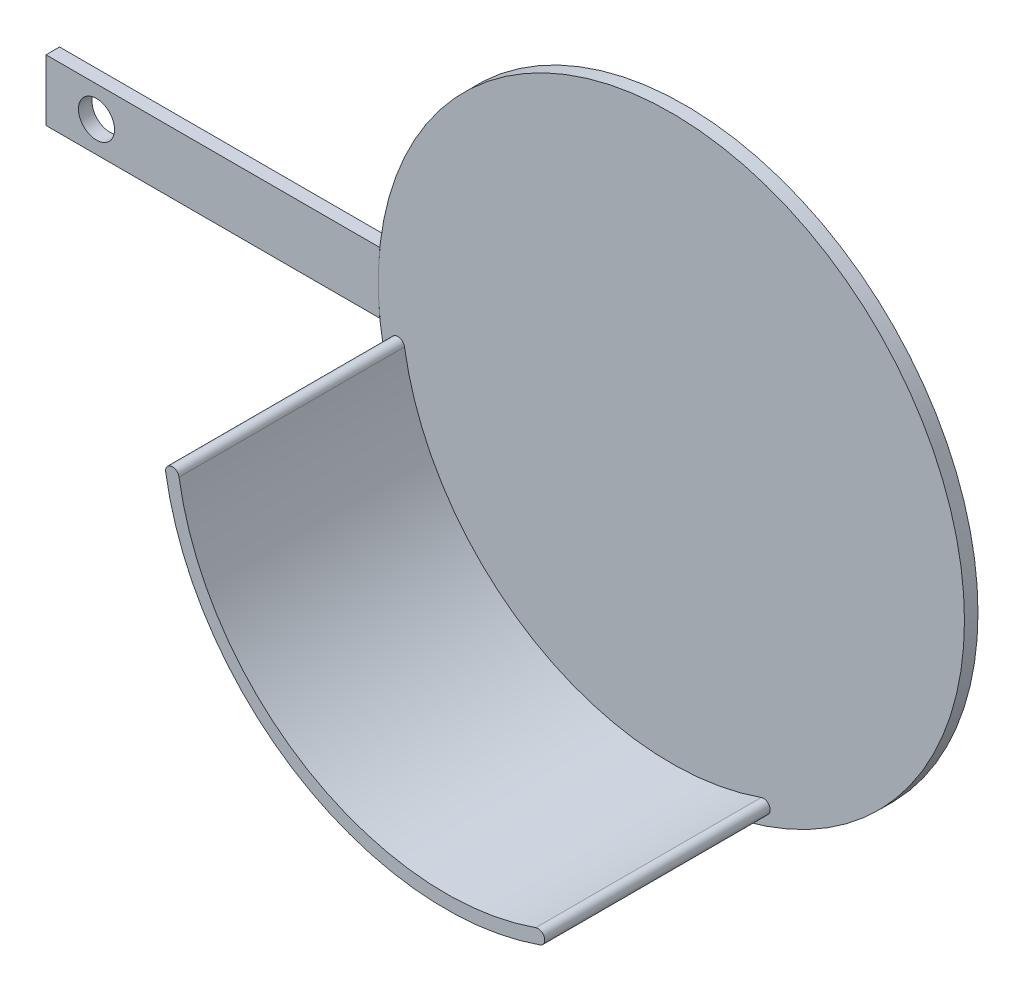
ISO-10303-21;
HEADER;
FILE_DESCRIPTION(('STEP AP214'),'2;1');
FILE_NAME('part.step','',(''),(''),'','','');
FILE_SCHEMA(('AUTOMOTIVE_DESIGN { 1 0 10303 214 1 1 1 1 }'));
ENDSEC;
DATA;
#1=APPLICATION_CONTEXT('core data for automotive mechanical design processes');
#2=APPLICATION_PROTOCOL_DEFINITION('international standard','automotive_design',2000,#1);
#3=PRODUCT_CONTEXT('',#1,'mechanical');
#4=PRODUCT('Part','Part','',(#3));
#5=PRODUCT_RELATED_PRODUCT_CATEGORY('part','',(#4));
#6=PRODUCT_DEFINITION_FORMATION('','',#4);
#7=PRODUCT_DEFINITION_CONTEXT('part definition',#1,'design');
#8=PRODUCT_DEFINITION('design','',#6,#7);
#9=PRODUCT_DEFINITION_SHAPE('','',#8);
#10=(LENGTH_UNIT() NAMED_UNIT(*) SI_UNIT(.MILLI.,.METRE.));
#11=(NAMED_UNIT(*) PLANE_ANGLE_UNIT() SI_UNIT($,.RADIAN.));
#12=(NAMED_UNIT(*) SI_UNIT($,.STERADIAN.) SOLID_ANGLE_UNIT());
#13=UNCERTAINTY_MEASURE_WITH_UNIT(LENGTH_MEASURE(1.E-05),#10,'distance_accuracy_value','');
#14=(GEOMETRIC_REPRESENTATION_CONTEXT(3) GLOBAL_UNCERTAINTY_ASSIGNED_CONTEXT((#13)) GLOBAL_UNIT_ASSIGNED_CONTEXT((#10,
#11,#12)) REPRESENTATION_CONTEXT('',''));
#15=CARTESIAN_POINT('',(0.,0.,0.));
#16=DIRECTION('',(0.,0.,1.));
#17=DIRECTION('',(1.,0.,0.));
#18=AXIS2_PLACEMENT_3D('',#15,#16,#17);
#19=CARTESIAN_POINT('',(0.,0.,3.));
#20=DIRECTION('',(0.,0.,-1.));
#21=DIRECTION('',(-1.,0.,0.));
#22=AXIS2_PLACEMENT_3D('',#19,#20,#21);
#23=CYLINDRICAL_SURFACE('',#22,65.);
#24=CARTESIAN_POINT('',(0.,0.,0.));
#25=DIRECTION('',(0.,0.,1.));
#26=DIRECTION('',(-1.,0.,0.));
#27=AXIS2_PLACEMENT_3D('',#24,#25,#26);
#28=CIRCLE('',#27,65.);
#29=CARTESIAN_POINT('',(-64.6439231989377,6.79435011239753,0.));
#30=VERTEX_POINT('',#29);
#31=CARTESIAN_POINT('',(-64.6439231989378,-6.79435011239749,0.));
#32=VERTEX_POINT('',#31);
#33=EDGE_CURVE('E115',#30,#32,#28,.T.);
#34=ORIENTED_EDGE('',*,*,#33,.F.);
#35=DIRECTION('',(0.,0.,-1.));
#36=VECTOR('',#35,1.);
#37=CARTESIAN_POINT('',(-64.6439231989377,6.79435011239753,3.));
#38=LINE('',#37,#36);
#39=CARTESIAN_POINT('',(-64.6439231989377,6.79435011239753,3.));
#40=VERTEX_POINT('',#39);
#41=EDGE_CURVE('E12',#40,#30,#38,.T.);
#42=ORIENTED_EDGE('',*,*,#41,.F.);
#43=CARTESIAN_POINT('',(0.,0.,3.));
#44=DIRECTION('',(0.,0.,1.));
#45=DIRECTION('',(-1.,0.,0.));
#46=AXIS2_PLACEMENT_3D('',#43,#44,#45);
#47=CIRCLE('',#46,65.);
#48=CARTESIAN_POINT('',(-64.6439231989378,-6.79435011239749,3.));
#49=VERTEX_POINT('',#48);
#50=EDGE_CURVE('E108',#40,#49,#47,.T.);
#51=ORIENTED_EDGE('',*,*,#50,.T.);
#52=DIRECTION('',(0.,0.,-1.));
#53=VECTOR('',#52,1.);
#54=CARTESIAN_POINT('',(-64.6439231989378,-6.79435011239749,3.));
#55=LINE('',#54,#53);
#56=EDGE_CURVE('E53',#49,#32,#55,.T.);
#57=ORIENTED_EDGE('',*,*,#56,.T.);
#58=EDGE_LOOP('',(#34,#42,#51,#57));
#59=FACE_BOUND('',#58,.T.);
#60=ADVANCED_FACE('F50',(#59),#23,.F.);
#61=CARTESIAN_POINT('',(-64.6439231989377,6.79435011239753,3.));
#62=DIRECTION('',(0.,1.,0.));
#63=DIRECTION('',(0.,0.,1.));
#64=AXIS2_PLACEMENT_3D('',#61,#62,#63);
#65=PLANE('',#64);
#66=DIRECTION('',(1.,0.,0.));
#67=VECTOR('',#66,1.);
#68=CARTESIAN_POINT('',(-64.6439231989377,6.79435011239753,0.));
#69=LINE('',#68,#67);
#70=CARTESIAN_POINT('',(-138.67252235542,6.79435011239753,0.));
#71=VERTEX_POINT('',#70);
#72=EDGE_CURVE('E110',#71,#30,#69,.T.);
#73=ORIENTED_EDGE('',*,*,#72,.F.);
#74=DIRECTION('',(0.,0.,-1.));
#75=VECTOR('',#74,1.);
#76=CARTESIAN_POINT('',(-138.67252235542,6.79435011239753,3.));
#77=LINE('',#76,#75);
#78=CARTESIAN_POINT('',(-138.67252235542,6.79435011239753,3.));
#79=VERTEX_POINT('',#78);
#80=EDGE_CURVE('E59',#79,#71,#77,.T.);
#81=ORIENTED_EDGE('',*,*,#80,.F.);
#82=DIRECTION('',(1.,0.,0.));
#83=VECTOR('',#82,1.);
#84=CARTESIAN_POINT('',(-64.6439231989377,6.79435011239753,3.));
#85=LINE('',#84,#83);
#86=EDGE_CURVE('E105',#79,#40,#85,.T.);
#87=ORIENTED_EDGE('',*,*,#86,.T.);
#88=ORIENTED_EDGE('',*,*,#41,.T.);
#89=EDGE_LOOP('',(#73,#81,#87,#88));
#90=FACE_BOUND('',#89,.T.);
#91=ADVANCED_FACE('F126',(#90),#65,.T.);
#92=CARTESIAN_POINT('',(-138.67252235542,-6.79435011239749,3.));
#93=DIRECTION('',(-1.,0.,0.));
#94=DIRECTION('',(0.,0.,1.));
#95=AXIS2_PLACEMENT_3D('',#92,#93,#94);
#96=PLANE('',#95);
#97=DIRECTION('',(0.,1.,0.));
#98=VECTOR('',#97,1.);
#99=CARTESIAN_POINT('',(-138.67252235542,-6.79435011239749,0.));
#100=LINE('',#99,#98);
#101=CARTESIAN_POINT('',(-138.67252235542,-6.79435011239749,0.));
#102=VERTEX_POINT('',#101);
#103=EDGE_CURVE('E100',#102,#71,#100,.T.);
#104=ORIENTED_EDGE('',*,*,#103,.F.);
#105=DIRECTION('',(0.,0.,-1.));
#106=VECTOR('',#105,1.);
#107=CARTESIAN_POINT('',(-138.67252235542,-6.79435011239749,3.));
#108=LINE('',#107,#106);
#109=CARTESIAN_POINT('',(-138.67252235542,-6.79435011239749,3.));
#110=VERTEX_POINT('',#109);
#111=EDGE_CURVE('E95',#110,#102,#108,.T.);
#112=ORIENTED_EDGE('',*,*,#111,.F.);
#113=DIRECTION('',(0.,1.,0.));
#114=VECTOR('',#113,1.);
#115=CARTESIAN_POINT('',(-138.67252235542,-6.79435011239749,3.));
#116=LINE('',#115,#114);
#117=EDGE_CURVE('E98',#110,#79,#116,.T.);
#118=ORIENTED_EDGE('',*,*,#117,.T.);
#119=ORIENTED_EDGE('',*,*,#80,.T.);
#120=EDGE_LOOP('',(#104,#112,#118,#119));
#121=FACE_BOUND('',#120,.T.);
#122=ADVANCED_FACE('F97',(#121),#96,.T.);
#123=CARTESIAN_POINT('',(-64.6439231989378,-6.79435011239749,3.));
#124=DIRECTION('',(0.,-1.,0.));
#125=DIRECTION('',(0.,0.,-1.));
#126=AXIS2_PLACEMENT_3D('',#123,#124,#125);
#127=PLANE('',#126);
#128=DIRECTION('',(-1.,0.,0.));
#129=VECTOR('',#128,1.);
#130=CARTESIAN_POINT('',(-64.6439231989378,-6.79435011239749,0.));
#131=LINE('',#130,#129);
#132=EDGE_CURVE('E118',#32,#102,#131,.T.);
#133=ORIENTED_EDGE('',*,*,#132,.F.);
#134=ORIENTED_EDGE('',*,*,#56,.F.);
#135=DIRECTION('',(-1.,0.,0.));
#136=VECTOR('',#135,1.);
#137=CARTESIAN_POINT('',(-64.6439231989378,-6.79435011239749,3.));
#138=LINE('',#137,#136);
#139=EDGE_CURVE('E104',#49,#110,#138,.T.);
#140=ORIENTED_EDGE('',*,*,#139,.T.);
#141=ORIENTED_EDGE('',*,*,#111,.T.);
#142=EDGE_LOOP('',(#133,#134,#140,#141));
#143=FACE_BOUND('',#142,.T.);
#144=ADVANCED_FACE('F107',(#143),#127,.T.);
#145=CARTESIAN_POINT('',(0.,0.,3.));
#146=DIRECTION('',(0.,0.,-1.));
#147=DIRECTION('',(-1.,0.,0.));
#148=AXIS2_PLACEMENT_3D('',#145,#146,#147);
#149=PLANE('',#148);
#150=CARTESIAN_POINT('',(-127.477067306325,0.,3.));
#151=DIRECTION('',(0.,0.,1.));
#152=DIRECTION('',(1.,0.,0.));
#153=AXIS2_PLACEMENT_3D('',#150,#151,#152);
#154=CIRCLE('',#153,4.00000000000001);
#155=CARTESIAN_POINT('',(-123.477067306325,0.,3.));
#156=VERTEX_POINT('',#155);
#157=EDGE_CURVE('E156',#156,#156,#154,.T.);
#158=ORIENTED_EDGE('',*,*,#157,.F.);
#159=EDGE_LOOP('',(#158));
#160=FACE_BOUND('',#159,.T.);
#161=ORIENTED_EDGE('',*,*,#50,.F.);
#162=ORIENTED_EDGE('',*,*,#86,.F.);
#163=ORIENTED_EDGE('',*,*,#117,.F.);
#164=ORIENTED_EDGE('',*,*,#139,.F.);
#165=EDGE_LOOP('',(#161,#162,#163,#164));
#166=FACE_BOUND('',#165,.T.);
#167=ADVANCED_FACE('F103',(#160,#166),#149,.F.);
#168=CARTESIAN_POINT('',(0.,0.,0.));
#169=DIRECTION('',(0.,0.,-1.));
#170=DIRECTION('',(-1.,0.,0.));
#171=AXIS2_PLACEMENT_3D('',#168,#169,#170);
#172=PLANE('',#171);
#173=CARTESIAN_POINT('',(-127.477067306325,0.,0.));
#174=DIRECTION('',(0.,0.,1.));
#175=DIRECTION('',(1.,0.,0.));
#176=AXIS2_PLACEMENT_3D('',#173,#174,#175);
#177=CIRCLE('',#176,4.00000000000001);
#178=CARTESIAN_POINT('',(-123.477067306325,0.,0.));
#179=VERTEX_POINT('',#178);
#180=EDGE_CURVE('E119',#179,#179,#177,.T.);
#181=ORIENTED_EDGE('',*,*,#180,.T.);
#182=EDGE_LOOP('',(#181));
#183=FACE_BOUND('',#182,.T.);
#184=ORIENTED_EDGE('',*,*,#33,.T.);
#185=ORIENTED_EDGE('',*,*,#132,.T.);
#186=ORIENTED_EDGE('',*,*,#103,.T.);
#187=ORIENTED_EDGE('',*,*,#72,.T.);
#188=EDGE_LOOP('',(#184,#185,#186,#187));
#189=FACE_BOUND('',#188,.T.);
#190=ADVANCED_FACE('F125',(#183,#189),#172,.T.);
#191=CARTESIAN_POINT('',(-127.477067306325,0.,0.));
#192=DIRECTION('',(0.,0.,1.));
#193=DIRECTION('',(1.,0.,0.));
#194=AXIS2_PLACEMENT_3D('',#191,#192,#193);
#195=CYLINDRICAL_SURFACE('',#194,4.00000000000001);
#196=ORIENTED_EDGE('',*,*,#180,.F.);
#197=EDGE_LOOP('',(#196));
#198=FACE_BOUND('',#197,.T.);
#199=ORIENTED_EDGE('',*,*,#157,.T.);
#200=EDGE_LOOP('',(#199));
#201=FACE_BOUND('',#200,.T.);
#202=ADVANCED_FACE('F144',(#198,#201),#195,.F.);
#203=CLOSED_SHELL('',(#60,#91,#122,#144,#167,#190,#202));
#204=MANIFOLD_SOLID_BREP('B2',#203);
#205=CARTESIAN_POINT('',(0.,0.,3.));
#206=DIRECTION('',(0.,0.,1.));
#207=DIRECTION('',(1.,0.,0.));
#208=AXIS2_PLACEMENT_3D('',#205,#206,#207);
#209=PLANE('',#208);
#210=CARTESIAN_POINT('',(0.,0.,3.));
#211=DIRECTION('',(0.,0.,1.));
#212=DIRECTION('',(1.,0.,0.));
#213=AXIS2_PLACEMENT_3D('',#210,#211,#212);
#214=CIRCLE('',#213,65.);
#215=CARTESIAN_POINT('',(65.,0.,3.));
#216=VERTEX_POINT('',#215);
#217=EDGE_CURVE('E48',#216,#216,#214,.T.);
#218=ORIENTED_EDGE('',*,*,#217,.T.);
#219=EDGE_LOOP('',(#218));
#220=FACE_BOUND('',#219,.T.);
#221=CARTESIAN_POINT('',(0.,0.,3.));
#222=DIRECTION('',(0.,0.,1.));
#223=DIRECTION('',(1.,0.,0.));
#224=AXIS2_PLACEMENT_3D('',#221,#222,#223);
#225=CIRCLE('',#224,62.9448291474381);
#226=CARTESIAN_POINT('',(-62.1390613458679,-10.0393511470931,3.));
#227=VERTEX_POINT('',#226);
#228=CARTESIAN_POINT('',(20.922915056466,-59.3656730943066,3.));
#229=VERTEX_POINT('',#228);
#230=EDGE_CURVE('E253',#227,#229,#225,.T.);
#231=ORIENTED_EDGE('',*,*,#230,.F.);
#232=CARTESIAN_POINT('',(-60.6582631090425,-9.80010946632906,3.));
#233=DIRECTION('',(0.,0.,1.));
#234=DIRECTION('',(1.,0.,0.));
#235=AXIS2_PLACEMENT_3D('',#232,#233,#234);
#236=CIRCLE('',#235,1.5);
#237=CARTESIAN_POINT('',(-59.1774648722171,-9.56086778556499,3.));
#238=VERTEX_POINT('',#237);
#239=EDGE_CURVE('E267',#238,#227,#236,.T.);
#240=ORIENTED_EDGE('',*,*,#239,.F.);
#241=CARTESIAN_POINT('',(0.,0.,3.));
#242=DIRECTION('',(0.,0.,-1.));
#243=DIRECTION('',(1.,0.,0.));
#244=AXIS2_PLACEMENT_3D('',#241,#242,#243);
#245=CIRCLE('',#244,59.9448291474381);
#246=CARTESIAN_POINT('',(19.9257124900348,-56.5362584832072,3.));
#247=VERTEX_POINT('',#246);
#248=EDGE_CURVE('E233',#247,#238,#245,.T.);
#249=ORIENTED_EDGE('',*,*,#248,.F.);
#250=CARTESIAN_POINT('',(20.4243137732504,-57.9509657887569,3.));
#251=DIRECTION('',(0.,0.,1.));
#252=DIRECTION('',(-1.,0.,0.));
#253=AXIS2_PLACEMENT_3D('',#250,#251,#252);
#254=CIRCLE('',#253,1.5);
#255=EDGE_CURVE('E273',#229,#247,#254,.T.);
#256=ORIENTED_EDGE('',*,*,#255,.F.);
#257=EDGE_LOOP('',(#231,#240,#249,#256));
#258=FACE_BOUND('',#257,.T.);
#259=ADVANCED_FACE('F195',(#220,#258),#209,.T.);
#260=CARTESIAN_POINT('',(0.,0.,3.));
#261=DIRECTION('',(0.,0.,-1.));
#262=DIRECTION('',(-1.,0.,0.));
#263=AXIS2_PLACEMENT_3D('',#260,#261,#262);
#264=CYLINDRICAL_SURFACE('',#263,65.);
#265=ORIENTED_EDGE('',*,*,#217,.F.);
#266=EDGE_LOOP('',(#265));
#267=FACE_BOUND('',#266,.T.);
#268=CARTESIAN_POINT('',(0.,0.,0.));
#269=DIRECTION('',(0.,0.,1.));
#270=DIRECTION('',(1.,0.,0.));
#271=AXIS2_PLACEMENT_3D('',#268,#269,#270);
#272=CIRCLE('',#271,65.);
#273=CARTESIAN_POINT('',(65.,0.,0.));
#274=VERTEX_POINT('',#273);
#275=EDGE_CURVE('E199',#274,#274,#272,.T.);
#276=ORIENTED_EDGE('',*,*,#275,.T.);
#277=EDGE_LOOP('',(#276));
#278=FACE_BOUND('',#277,.T.);
#279=ADVANCED_FACE('F197',(#267,#278),#264,.T.);
#280=CARTESIAN_POINT('',(0.,0.,0.));
#281=DIRECTION('',(0.,0.,1.));
#282=DIRECTION('',(1.,0.,0.));
#283=AXIS2_PLACEMENT_3D('',#280,#281,#282);
#284=PLANE('',#283);
#285=ORIENTED_EDGE('',*,*,#275,.F.);
#286=EDGE_LOOP('',(#285));
#287=FACE_BOUND('',#286,.T.);
#288=ADVANCED_FACE('F288',(#287),#284,.F.);
#289=CARTESIAN_POINT('',(-60.6582631090425,-9.80010946632906,53.));
#290=DIRECTION('',(0.,0.,-1.));
#291=DIRECTION('',(-1.,0.,0.));
#292=AXIS2_PLACEMENT_3D('',#289,#290,#291);
#293=CYLINDRICAL_SURFACE('',#292,1.5);
#294=ORIENTED_EDGE('',*,*,#239,.T.);
#295=DIRECTION('',(0.,0.,-1.));
#296=VECTOR('',#295,1.);
#297=CARTESIAN_POINT('',(-62.1390613458679,-10.0393511470931,53.));
#298=LINE('',#297,#296);
#299=CARTESIAN_POINT('',(-62.1390613458679,-10.0393511470931,53.));
#300=VERTEX_POINT('',#299);
#301=EDGE_CURVE('E257',#300,#227,#298,.T.);
#302=ORIENTED_EDGE('',*,*,#301,.F.);
#303=CARTESIAN_POINT('',(-60.6582631090425,-9.80010946632906,53.));
#304=DIRECTION('',(0.,0.,1.));
#305=DIRECTION('',(1.,0.,0.));
#306=AXIS2_PLACEMENT_3D('',#303,#304,#305);
#307=CIRCLE('',#306,1.5);
#308=CARTESIAN_POINT('',(-59.1774648722171,-9.56086778556499,53.));
#309=VERTEX_POINT('',#308);
#310=EDGE_CURVE('E245',#309,#300,#307,.T.);
#311=ORIENTED_EDGE('',*,*,#310,.F.);
#312=DIRECTION('',(0.,0.,-1.));
#313=VECTOR('',#312,1.);
#314=CARTESIAN_POINT('',(-59.1774648722171,-9.56086778556499,53.));
#315=LINE('',#314,#313);
#316=EDGE_CURVE('E263',#309,#238,#315,.T.);
#317=ORIENTED_EDGE('',*,*,#316,.T.);
#318=EDGE_LOOP('',(#294,#302,#311,#317));
#319=FACE_BOUND('',#318,.T.);
#320=ADVANCED_FACE('F290',(#319),#293,.T.);
#321=CARTESIAN_POINT('',(0.,0.,53.));
#322=DIRECTION('',(0.,0.,-1.));
#323=DIRECTION('',(-1.,0.,0.));
#324=AXIS2_PLACEMENT_3D('',#321,#322,#323);
#325=CYLINDRICAL_SURFACE('',#324,62.9448291474381);
#326=ORIENTED_EDGE('',*,*,#230,.T.);
#327=DIRECTION('',(0.,0.,-1.));
#328=VECTOR('',#327,1.);
#329=CARTESIAN_POINT('',(20.922915056466,-59.3656730943066,53.));
#330=LINE('',#329,#328);
#331=CARTESIAN_POINT('',(20.922915056466,-59.3656730943066,53.));
#332=VERTEX_POINT('',#331);
#333=EDGE_CURVE('E250',#332,#229,#330,.T.);
#334=ORIENTED_EDGE('',*,*,#333,.F.);
#335=CARTESIAN_POINT('',(0.,0.,53.));
#336=DIRECTION('',(0.,0.,1.));
#337=DIRECTION('',(1.,0.,0.));
#338=AXIS2_PLACEMENT_3D('',#335,#336,#337);
#339=CIRCLE('',#338,62.9448291474381);
#340=EDGE_CURVE('E240',#300,#332,#339,.T.);
#341=ORIENTED_EDGE('',*,*,#340,.F.);
#342=ORIENTED_EDGE('',*,*,#301,.T.);
#343=EDGE_LOOP('',(#326,#334,#341,#342));
#344=FACE_BOUND('',#343,.T.);
#345=ADVANCED_FACE('F251',(#344),#325,.T.);
#346=CARTESIAN_POINT('',(20.4243137732504,-57.9509657887569,53.));
#347=DIRECTION('',(0.,0.,-1.));
#348=DIRECTION('',(-1.,0.,0.));
#349=AXIS2_PLACEMENT_3D('',#346,#347,#348);
#350=CYLINDRICAL_SURFACE('',#349,1.5);
#351=ORIENTED_EDGE('',*,*,#255,.T.);
#352=DIRECTION('',(0.,0.,-1.));
#353=VECTOR('',#352,1.);
#354=CARTESIAN_POINT('',(19.9257124900348,-56.5362584832072,53.));
#355=LINE('',#354,#353);
#356=CARTESIAN_POINT('',(19.9257124900348,-56.5362584832072,53.));
#357=VERTEX_POINT('',#356);
#358=EDGE_CURVE('E211',#357,#247,#355,.T.);
#359=ORIENTED_EDGE('',*,*,#358,.F.);
#360=CARTESIAN_POINT('',(20.4243137732504,-57.9509657887569,53.));
#361=DIRECTION('',(0.,0.,1.));
#362=DIRECTION('',(-1.,0.,0.));
#363=AXIS2_PLACEMENT_3D('',#360,#361,#362);
#364=CIRCLE('',#363,1.5);
#365=EDGE_CURVE('E243',#332,#357,#364,.T.);
#366=ORIENTED_EDGE('',*,*,#365,.F.);
#367=ORIENTED_EDGE('',*,*,#333,.T.);
#368=EDGE_LOOP('',(#351,#359,#366,#367));
#369=FACE_BOUND('',#368,.T.);
#370=ADVANCED_FACE('F259',(#369),#350,.T.);
#371=CARTESIAN_POINT('',(0.,0.,53.));
#372=DIRECTION('',(0.,0.,-1.));
#373=DIRECTION('',(-1.,0.,0.));
#374=AXIS2_PLACEMENT_3D('',#371,#372,#373);
#375=CYLINDRICAL_SURFACE('',#374,59.9448291474381);
#376=ORIENTED_EDGE('',*,*,#248,.T.);
#377=ORIENTED_EDGE('',*,*,#316,.F.);
#378=CARTESIAN_POINT('',(0.,0.,53.));
#379=DIRECTION('',(0.,0.,-1.));
#380=DIRECTION('',(1.,0.,0.));
#381=AXIS2_PLACEMENT_3D('',#378,#379,#380);
#382=CIRCLE('',#381,59.9448291474381);
#383=EDGE_CURVE('E219',#357,#309,#382,.T.);
#384=ORIENTED_EDGE('',*,*,#383,.F.);
#385=ORIENTED_EDGE('',*,*,#358,.T.);
#386=EDGE_LOOP('',(#376,#377,#384,#385));
#387=FACE_BOUND('',#386,.T.);
#388=ADVANCED_FACE('F311',(#387),#375,.F.);
#389=CARTESIAN_POINT('',(-30.3291315545212,-4.90005473316453,53.));
#390=DIRECTION('',(0.,0.,1.));
#391=DIRECTION('',(1.,0.,0.));
#392=AXIS2_PLACEMENT_3D('',#389,#390,#391);
#393=PLANE('',#392);
#394=ORIENTED_EDGE('',*,*,#310,.T.);
#395=ORIENTED_EDGE('',*,*,#340,.T.);
#396=ORIENTED_EDGE('',*,*,#365,.T.);
#397=ORIENTED_EDGE('',*,*,#383,.T.);
#398=EDGE_LOOP('',(#394,#395,#396,#397));
#399=FACE_BOUND('',#398,.T.);
#400=ADVANCED_FACE('F241',(#399),#393,.T.);
#401=CLOSED_SHELL('',(#259,#279,#288,#320,#345,#370,#388,#400));
#402=MANIFOLD_SOLID_BREP('B6',#401);
#403=ADVANCED_BREP_SHAPE_REPRESENTATION('',(#18,#204,#402),#14);
#404=SHAPE_DEFINITION_REPRESENTATION(#9,#403);
ENDSEC;
END-ISO-10303-21;
